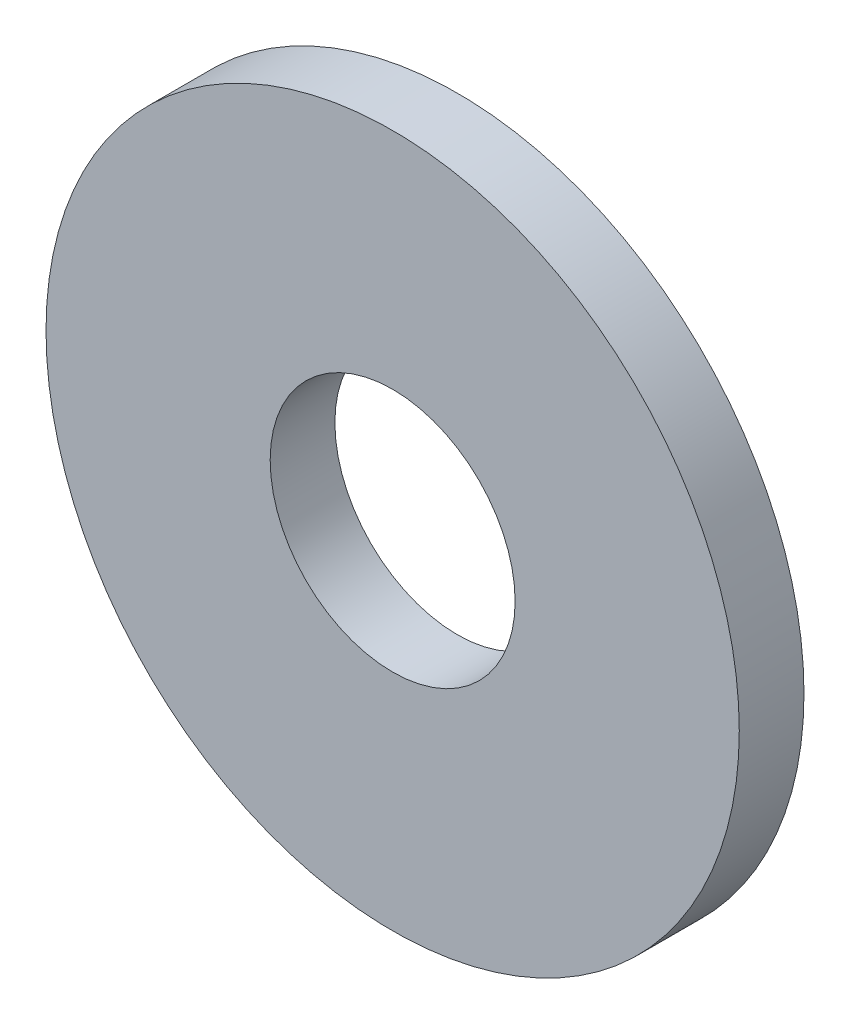
ISO-10303-21;
HEADER;
FILE_DESCRIPTION(('STEP AP214'),'2;1');
FILE_NAME('part.step','',(''),(''),'','','');
FILE_SCHEMA(('AUTOMOTIVE_DESIGN { 1 0 10303 214 1 1 1 1 }'));
ENDSEC;
DATA;
#1=APPLICATION_CONTEXT('core data for automotive mechanical design processes');
#2=APPLICATION_PROTOCOL_DEFINITION('international standard','automotive_design',2000,#1);
#3=PRODUCT_CONTEXT('',#1,'mechanical');
#4=PRODUCT('Part','Part','',(#3));
#5=PRODUCT_RELATED_PRODUCT_CATEGORY('part','',(#4));
#6=PRODUCT_DEFINITION_FORMATION('','',#4);
#7=PRODUCT_DEFINITION_CONTEXT('part definition',#1,'design');
#8=PRODUCT_DEFINITION('design','',#6,#7);
#9=PRODUCT_DEFINITION_SHAPE('','',#8);
#10=(LENGTH_UNIT() NAMED_UNIT(*) SI_UNIT(.MILLI.,.METRE.));
#11=(NAMED_UNIT(*) PLANE_ANGLE_UNIT() SI_UNIT($,.RADIAN.));
#12=(NAMED_UNIT(*) SI_UNIT($,.STERADIAN.) SOLID_ANGLE_UNIT());
#13=UNCERTAINTY_MEASURE_WITH_UNIT(LENGTH_MEASURE(1.E-05),#10,'distance_accuracy_value','');
#14=(GEOMETRIC_REPRESENTATION_CONTEXT(3) GLOBAL_UNCERTAINTY_ASSIGNED_CONTEXT((#13)) GLOBAL_UNIT_ASSIGNED_CONTEXT((#10,
#11,#12)) REPRESENTATION_CONTEXT('',''));
#15=CARTESIAN_POINT('',(0.,0.,0.));
#16=DIRECTION('',(0.,0.,1.));
#17=DIRECTION('',(1.,0.,0.));
#18=AXIS2_PLACEMENT_3D('',#15,#16,#17);
#19=CARTESIAN_POINT('',(0.,0.,1.4));
#20=DIRECTION('',(0.,0.,1.));
#21=DIRECTION('',(1.,0.,0.));
#22=AXIS2_PLACEMENT_3D('',#19,#20,#21);
#23=PLANE('',#22);
#24=CARTESIAN_POINT('',(0.,0.,1.4));
#25=DIRECTION('',(0.,0.,1.));
#26=DIRECTION('',(1.,0.,0.));
#27=AXIS2_PLACEMENT_3D('',#24,#25,#26);
#28=CIRCLE('',#27,7.5);
#29=CARTESIAN_POINT('',(7.5,0.,1.4));
#30=VERTEX_POINT('',#29);
#31=EDGE_CURVE('E10',#30,#30,#28,.T.);
#32=ORIENTED_EDGE('',*,*,#31,.T.);
#33=EDGE_LOOP('',(#32));
#34=FACE_BOUND('',#33,.T.);
#35=CARTESIAN_POINT('',(0.,0.,1.4));
#36=DIRECTION('',(0.,0.,1.));
#37=DIRECTION('',(1.,0.,0.));
#38=AXIS2_PLACEMENT_3D('',#35,#36,#37);
#39=CIRCLE('',#38,2.65);
#40=CARTESIAN_POINT('',(2.65,0.,1.4));
#41=VERTEX_POINT('',#40);
#42=EDGE_CURVE('E41',#41,#41,#39,.T.);
#43=ORIENTED_EDGE('',*,*,#42,.F.);
#44=EDGE_LOOP('',(#43));
#45=FACE_BOUND('',#44,.T.);
#46=ADVANCED_FACE('F30',(#34,#45),#23,.T.);
#47=CARTESIAN_POINT('',(0.,0.,0.));
#48=DIRECTION('',(0.,0.,1.));
#49=DIRECTION('',(1.,0.,0.));
#50=AXIS2_PLACEMENT_3D('',#47,#48,#49);
#51=PLANE('',#50);
#52=CARTESIAN_POINT('',(0.,0.,0.));
#53=DIRECTION('',(0.,0.,1.));
#54=DIRECTION('',(1.,0.,0.));
#55=AXIS2_PLACEMENT_3D('',#52,#53,#54);
#56=CIRCLE('',#55,7.5);
#57=CARTESIAN_POINT('',(7.5,0.,0.));
#58=VERTEX_POINT('',#57);
#59=EDGE_CURVE('E34',#58,#58,#56,.T.);
#60=ORIENTED_EDGE('',*,*,#59,.F.);
#61=EDGE_LOOP('',(#60));
#62=FACE_BOUND('',#61,.T.);
#63=CARTESIAN_POINT('',(0.,0.,0.));
#64=DIRECTION('',(0.,0.,1.));
#65=DIRECTION('',(1.,0.,0.));
#66=AXIS2_PLACEMENT_3D('',#63,#64,#65);
#67=CIRCLE('',#66,2.65);
#68=CARTESIAN_POINT('',(2.65,0.,0.));
#69=VERTEX_POINT('',#68);
#70=EDGE_CURVE('E43',#69,#69,#67,.T.);
#71=ORIENTED_EDGE('',*,*,#70,.T.);
#72=EDGE_LOOP('',(#71));
#73=FACE_BOUND('',#72,.T.);
#74=ADVANCED_FACE('F53',(#62,#73),#51,.F.);
#75=CARTESIAN_POINT('',(0.,0.,1.4));
#76=DIRECTION('',(0.,0.,-1.));
#77=DIRECTION('',(-1.,0.,0.));
#78=AXIS2_PLACEMENT_3D('',#75,#76,#77);
#79=CYLINDRICAL_SURFACE('',#78,7.5);
#80=ORIENTED_EDGE('',*,*,#31,.F.);
#81=EDGE_LOOP('',(#80));
#82=FACE_BOUND('',#81,.T.);
#83=ORIENTED_EDGE('',*,*,#59,.T.);
#84=EDGE_LOOP('',(#83));
#85=FACE_BOUND('',#84,.T.);
#86=ADVANCED_FACE('F32',(#82,#85),#79,.T.);
#87=CARTESIAN_POINT('',(0.,0.,1.4));
#88=DIRECTION('',(0.,0.,-1.));
#89=DIRECTION('',(-1.,0.,0.));
#90=AXIS2_PLACEMENT_3D('',#87,#88,#89);
#91=CYLINDRICAL_SURFACE('',#90,2.65);
#92=ORIENTED_EDGE('',*,*,#42,.T.);
#93=EDGE_LOOP('',(#92));
#94=FACE_BOUND('',#93,.T.);
#95=ORIENTED_EDGE('',*,*,#70,.F.);
#96=EDGE_LOOP('',(#95));
#97=FACE_BOUND('',#96,.T.);
#98=ADVANCED_FACE('F49',(#94,#97),#91,.F.);
#99=CLOSED_SHELL('',(#46,#74,#86,#98));
#100=MANIFOLD_SOLID_BREP('B2',#99);
#101=ADVANCED_BREP_SHAPE_REPRESENTATION('',(#18,#100),#14);
#102=SHAPE_DEFINITION_REPRESENTATION(#9,#101);
ENDSEC;
END-ISO-10303-21;
